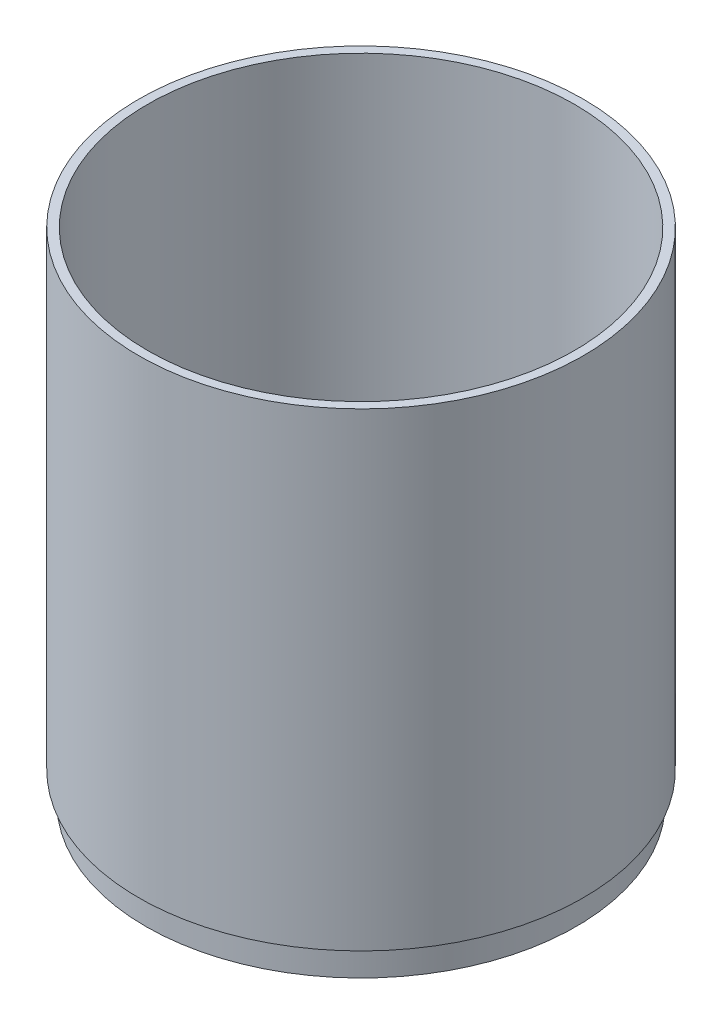
ISO-10303-21;
HEADER;
FILE_DESCRIPTION(('STEP AP214'),'2;1');
FILE_NAME('part.step','',(''),(''),'','','');
FILE_SCHEMA(('AUTOMOTIVE_DESIGN { 1 0 10303 214 1 1 1 1 }'));
ENDSEC;
DATA;
#1=APPLICATION_CONTEXT('core data for automotive mechanical design processes');
#2=APPLICATION_PROTOCOL_DEFINITION('international standard','automotive_design',2000,#1);
#3=PRODUCT_CONTEXT('',#1,'mechanical');
#4=PRODUCT('Part','Part','',(#3));
#5=PRODUCT_RELATED_PRODUCT_CATEGORY('part','',(#4));
#6=PRODUCT_DEFINITION_FORMATION('','',#4);
#7=PRODUCT_DEFINITION_CONTEXT('part definition',#1,'design');
#8=PRODUCT_DEFINITION('design','',#6,#7);
#9=PRODUCT_DEFINITION_SHAPE('','',#8);
#10=(LENGTH_UNIT() NAMED_UNIT(*) SI_UNIT(.MILLI.,.METRE.));
#11=(NAMED_UNIT(*) PLANE_ANGLE_UNIT() SI_UNIT($,.RADIAN.));
#12=(NAMED_UNIT(*) SI_UNIT($,.STERADIAN.) SOLID_ANGLE_UNIT());
#13=UNCERTAINTY_MEASURE_WITH_UNIT(LENGTH_MEASURE(1.E-05),#10,'distance_accuracy_value','');
#14=(GEOMETRIC_REPRESENTATION_CONTEXT(3) GLOBAL_UNCERTAINTY_ASSIGNED_CONTEXT((#13)) GLOBAL_UNIT_ASSIGNED_CONTEXT((#10,
#11,#12)) REPRESENTATION_CONTEXT('',''));
#15=CARTESIAN_POINT('',(0.,0.,0.));
#16=DIRECTION('',(0.,0.,1.));
#17=DIRECTION('',(1.,0.,0.));
#18=AXIS2_PLACEMENT_3D('',#15,#16,#17);
#19=CARTESIAN_POINT('',(60.5,0.,0.));
#20=DIRECTION('',(0.,-1.,0.));
#21=DIRECTION('',(0.,0.,-1.));
#22=AXIS2_PLACEMENT_3D('',#19,#20,#21);
#23=PLANE('',#22);
#24=CARTESIAN_POINT('',(0.,0.,0.));
#25=DIRECTION('',(0.,-1.,0.));
#26=DIRECTION('',(0.,0.,-1.));
#27=AXIS2_PLACEMENT_3D('',#24,#25,#26);
#28=CIRCLE('',#27,60.5);
#29=CARTESIAN_POINT('',(0.,0.,-60.5));
#30=VERTEX_POINT('',#29);
#31=EDGE_CURVE('E11',#30,#30,#28,.T.);
#32=ORIENTED_EDGE('',*,*,#31,.T.);
#33=EDGE_LOOP('',(#32));
#34=FACE_BOUND('',#33,.T.);
#35=CARTESIAN_POINT('',(0.,0.,0.));
#36=DIRECTION('',(0.,-1.,0.));
#37=DIRECTION('',(0.,0.,-1.));
#38=AXIS2_PLACEMENT_3D('',#35,#36,#37);
#39=CIRCLE('',#38,15.);
#40=CARTESIAN_POINT('',(0.,0.,-15.));
#41=VERTEX_POINT('',#40);
#42=EDGE_CURVE('E50',#41,#41,#39,.T.);
#43=ORIENTED_EDGE('',*,*,#42,.F.);
#44=EDGE_LOOP('',(#43));
#45=FACE_BOUND('',#44,.T.);
#46=DIRECTION('',(-1.,0.,0.));
#47=VECTOR('',#46,1.);
#48=CARTESIAN_POINT('',(60.5,0.,4.00000000000063));
#49=LINE('',#48,#47);
#50=CARTESIAN_POINT('',(58.3630876496437,0.,4.0000000000006));
#51=VERTEX_POINT('',#50);
#52=CARTESIAN_POINT('',(19.5959179422654,0.,4.0000000000002));
#53=VERTEX_POINT('',#52);
#54=EDGE_CURVE('E269',#51,#53,#49,.T.);
#55=ORIENTED_EDGE('',*,*,#54,.T.);
#56=CARTESIAN_POINT('',(0.,0.,0.));
#57=DIRECTION('',(0.,-1.,0.));
#58=DIRECTION('',(0.,0.,-1.));
#59=AXIS2_PLACEMENT_3D('',#56,#57,#58);
#60=CIRCLE('',#59,20.);
#61=CARTESIAN_POINT('',(4.,0.,19.5959179422654));
#62=VERTEX_POINT('',#61);
#63=EDGE_CURVE('E273',#53,#62,#60,.T.);
#64=ORIENTED_EDGE('',*,*,#63,.T.);
#65=DIRECTION('',(0.,0.,-1.));
#66=VECTOR('',#65,1.);
#67=CARTESIAN_POINT('',(4.,0.,0.));
#68=LINE('',#67,#66);
#69=CARTESIAN_POINT('',(4.,0.,58.3630876496438));
#70=VERTEX_POINT('',#69);
#71=EDGE_CURVE('E253',#70,#62,#68,.T.);
#72=ORIENTED_EDGE('',*,*,#71,.F.);
#73=CARTESIAN_POINT('',(0.,0.,0.));
#74=DIRECTION('',(0.,-1.,0.));
#75=DIRECTION('',(0.,0.,-1.));
#76=AXIS2_PLACEMENT_3D('',#73,#74,#75);
#77=CIRCLE('',#76,58.5);
#78=EDGE_CURVE('E265',#51,#70,#77,.T.);
#79=ORIENTED_EDGE('',*,*,#78,.F.);
#80=EDGE_LOOP('',(#55,#64,#72,#79));
#81=FACE_BOUND('',#80,.T.);
#82=DIRECTION('',(-0.382683432365091,0.,0.923879532511287));
#83=VECTOR('',#82,1.);
#84=CARTESIAN_POINT('',(8.86001986910698,0.,-21.3899801308931));
#85=LINE('',#84,#83);
#86=CARTESIAN_POINT('',(22.3869807933578,0.,-54.0469526519103));
#87=VERTEX_POINT('',#86);
#88=CARTESIAN_POINT('',(7.65366864730181,0.,-18.4775906502257));
#89=VERTEX_POINT('',#88);
#90=EDGE_CURVE('E283',#87,#89,#85,.T.);
#91=ORIENTED_EDGE('',*,*,#90,.T.);
#92=CARTESIAN_POINT('',(0.,0.,0.));
#93=DIRECTION('',(0.,-1.,0.));
#94=DIRECTION('',(0.,0.,-1.));
#95=AXIS2_PLACEMENT_3D('',#92,#93,#94);
#96=CIRCLE('',#95,20.);
#97=CARTESIAN_POINT('',(19.5959179422655,0.,-3.99999999999979));
#98=VERTEX_POINT('',#97);
#99=EDGE_CURVE('E287',#89,#98,#96,.T.);
#100=ORIENTED_EDGE('',*,*,#99,.T.);
#101=DIRECTION('',(-1.,0.,0.));
#102=VECTOR('',#101,1.);
#103=CARTESIAN_POINT('',(60.5,0.,-3.99999999999936));
#104=LINE('',#103,#102);
#105=CARTESIAN_POINT('',(58.3630876496438,0.,-3.99999999999938));
#106=VERTEX_POINT('',#105);
#107=EDGE_CURVE('E161',#106,#98,#104,.T.);
#108=ORIENTED_EDGE('',*,*,#107,.F.);
#109=CARTESIAN_POINT('',(0.,0.,0.));
#110=DIRECTION('',(0.,-1.,0.));
#111=DIRECTION('',(0.,0.,-1.));
#112=AXIS2_PLACEMENT_3D('',#109,#110,#111);
#113=CIRCLE('',#112,58.5);
#114=EDGE_CURVE('E279',#87,#106,#113,.T.);
#115=ORIENTED_EDGE('',*,*,#114,.F.);
#116=EDGE_LOOP('',(#91,#100,#108,#115));
#117=FACE_BOUND('',#116,.T.);
#118=DIRECTION('',(1.,0.,0.));
#119=VECTOR('',#118,1.);
#120=CARTESIAN_POINT('',(60.5,0.,-3.9999999999998));
#121=LINE('',#120,#119);
#122=CARTESIAN_POINT('',(-58.3630876496437,0.,-4.0000000000002));
#123=VERTEX_POINT('',#122);
#124=CARTESIAN_POINT('',(-19.5959179422654,0.,-4.00000000000007));
#125=VERTEX_POINT('',#124);
#126=EDGE_CURVE('E296',#123,#125,#121,.T.);
#127=ORIENTED_EDGE('',*,*,#126,.T.);
#128=CARTESIAN_POINT('',(0.,0.,0.));
#129=DIRECTION('',(0.,-1.,0.));
#130=DIRECTION('',(0.,0.,-1.));
#131=AXIS2_PLACEMENT_3D('',#128,#129,#130);
#132=CIRCLE('',#131,20.);
#133=CARTESIAN_POINT('',(-7.65366864730181,0.,-18.4775906502257));
#134=VERTEX_POINT('',#133);
#135=EDGE_CURVE('E300',#125,#134,#132,.T.);
#136=ORIENTED_EDGE('',*,*,#135,.T.);
#137=DIRECTION('',(0.382683432365091,0.,0.923879532511287));
#138=VECTOR('',#137,1.);
#139=CARTESIAN_POINT('',(8.86001986910698,0.,21.3899801308931));
#140=LINE('',#139,#138);
#141=CARTESIAN_POINT('',(-22.3869807933578,0.,-54.0469526519103));
#142=VERTEX_POINT('',#141);
#143=EDGE_CURVE('E290',#142,#134,#140,.T.);
#144=ORIENTED_EDGE('',*,*,#143,.F.);
#145=CARTESIAN_POINT('',(0.,0.,0.));
#146=DIRECTION('',(0.,-1.,0.));
#147=DIRECTION('',(0.,0.,-1.));
#148=AXIS2_PLACEMENT_3D('',#145,#146,#147);
#149=CIRCLE('',#148,58.5);
#150=EDGE_CURVE('E293',#123,#142,#149,.T.);
#151=ORIENTED_EDGE('',*,*,#150,.F.);
#152=EDGE_LOOP('',(#127,#136,#144,#151));
#153=FACE_BOUND('',#152,.T.);
#154=DIRECTION('',(0.,0.,-1.));
#155=VECTOR('',#154,1.);
#156=CARTESIAN_POINT('',(-4.,0.,0.));
#157=LINE('',#156,#155);
#158=CARTESIAN_POINT('',(-3.99999999999999,0.,58.3630876496438));
#159=VERTEX_POINT('',#158);
#160=CARTESIAN_POINT('',(-4.,0.,19.5959179422654));
#161=VERTEX_POINT('',#160);
#162=EDGE_CURVE('E310',#159,#161,#157,.T.);
#163=ORIENTED_EDGE('',*,*,#162,.T.);
#164=CARTESIAN_POINT('',(0.,0.,0.));
#165=DIRECTION('',(0.,-1.,0.));
#166=DIRECTION('',(0.,0.,-1.));
#167=AXIS2_PLACEMENT_3D('',#164,#165,#166);
#168=CIRCLE('',#167,20.);
#169=CARTESIAN_POINT('',(-19.5959179422654,0.,3.99999999999993));
#170=VERTEX_POINT('',#169);
#171=EDGE_CURVE('E314',#161,#170,#168,.T.);
#172=ORIENTED_EDGE('',*,*,#171,.T.);
#173=DIRECTION('',(1.,0.,0.));
#174=VECTOR('',#173,1.);
#175=CARTESIAN_POINT('',(60.5,0.,4.00000000000022));
#176=LINE('',#175,#174);
#177=CARTESIAN_POINT('',(-58.3630876496438,0.,3.99999999999979));
#178=VERTEX_POINT('',#177);
#179=EDGE_CURVE('E304',#178,#170,#176,.T.);
#180=ORIENTED_EDGE('',*,*,#179,.F.);
#181=CARTESIAN_POINT('',(0.,0.,0.));
#182=DIRECTION('',(0.,-1.,0.));
#183=DIRECTION('',(0.,0.,-1.));
#184=AXIS2_PLACEMENT_3D('',#181,#182,#183);
#185=CIRCLE('',#184,58.5);
#186=EDGE_CURVE('E307',#159,#178,#185,.T.);
#187=ORIENTED_EDGE('',*,*,#186,.F.);
#188=EDGE_LOOP('',(#163,#172,#180,#187));
#189=FACE_BOUND('',#188,.T.);
#190=ADVANCED_FACE('F41',(#34,#45,#81,#117,#153,#189),#23,.T.);
#191=CARTESIAN_POINT('',(58.5,4.,0.));
#192=DIRECTION('',(0.,1.,0.));
#193=DIRECTION('',(0.,0.,1.));
#194=AXIS2_PLACEMENT_3D('',#191,#192,#193);
#195=PLANE('',#194);
#196=CARTESIAN_POINT('',(0.,4.,0.));
#197=DIRECTION('',(0.,-1.,0.));
#198=DIRECTION('',(0.,0.,-1.));
#199=AXIS2_PLACEMENT_3D('',#196,#197,#198);
#200=CIRCLE('',#199,15.);
#201=CARTESIAN_POINT('',(0.,4.,-15.));
#202=VERTEX_POINT('',#201);
#203=EDGE_CURVE('E347',#202,#202,#200,.T.);
#204=ORIENTED_EDGE('',*,*,#203,.T.);
#205=EDGE_LOOP('',(#204));
#206=FACE_BOUND('',#205,.T.);
#207=CARTESIAN_POINT('',(0.,4.,0.));
#208=DIRECTION('',(0.,1.,0.));
#209=DIRECTION('',(0.,0.,1.));
#210=AXIS2_PLACEMENT_3D('',#207,#208,#209);
#211=CIRCLE('',#210,20.);
#212=CARTESIAN_POINT('',(-19.5959179422654,4.,3.99999999999993));
#213=VERTEX_POINT('',#212);
#214=CARTESIAN_POINT('',(-4.,4.,19.5959179422654));
#215=VERTEX_POINT('',#214);
#216=EDGE_CURVE('E220',#213,#215,#211,.T.);
#217=ORIENTED_EDGE('',*,*,#216,.T.);
#218=DIRECTION('',(0.,0.,1.));
#219=VECTOR('',#218,1.);
#220=CARTESIAN_POINT('',(-4.,4.,0.));
#221=LINE('',#220,#219);
#222=CARTESIAN_POINT('',(-3.99999999999999,4.,58.3630876496438));
#223=VERTEX_POINT('',#222);
#224=EDGE_CURVE('E226',#215,#223,#221,.T.);
#225=ORIENTED_EDGE('',*,*,#224,.T.);
#226=CARTESIAN_POINT('',(0.,4.00000000000001,0.));
#227=DIRECTION('',(0.,-1.,0.));
#228=DIRECTION('',(0.,0.,-1.));
#229=AXIS2_PLACEMENT_3D('',#226,#227,#228);
#230=CIRCLE('',#229,58.5);
#231=CARTESIAN_POINT('',(3.99999999999999,4.00000000000001,58.3630876496438));
#232=VERTEX_POINT('',#231);
#233=EDGE_CURVE('E378',#232,#223,#230,.T.);
#234=ORIENTED_EDGE('',*,*,#233,.F.);
#235=DIRECTION('',(0.,0.,1.));
#236=VECTOR('',#235,1.);
#237=CARTESIAN_POINT('',(4.,4.,0.));
#238=LINE('',#237,#236);
#239=CARTESIAN_POINT('',(4.,4.,19.5959179422654));
#240=VERTEX_POINT('',#239);
#241=EDGE_CURVE('E243',#240,#232,#238,.T.);
#242=ORIENTED_EDGE('',*,*,#241,.F.);
#243=CARTESIAN_POINT('',(0.,4.,0.));
#244=DIRECTION('',(0.,1.,0.));
#245=DIRECTION('',(0.,0.,1.));
#246=AXIS2_PLACEMENT_3D('',#243,#244,#245);
#247=CIRCLE('',#246,20.);
#248=CARTESIAN_POINT('',(19.5959179422654,4.,4.0000000000002));
#249=VERTEX_POINT('',#248);
#250=EDGE_CURVE('E192',#240,#249,#247,.T.);
#251=ORIENTED_EDGE('',*,*,#250,.T.);
#252=DIRECTION('',(1.,0.,0.));
#253=VECTOR('',#252,1.);
#254=CARTESIAN_POINT('',(0.,4.,4.));
#255=LINE('',#254,#253);
#256=CARTESIAN_POINT('',(58.3630876496437,4.,4.0000000000006));
#257=VERTEX_POINT('',#256);
#258=EDGE_CURVE('E246',#249,#257,#255,.T.);
#259=ORIENTED_EDGE('',*,*,#258,.T.);
#260=CARTESIAN_POINT('',(58.3630876496438,4.00000000000001,-3.99999999999938));
#261=VERTEX_POINT('',#260);
#262=EDGE_CURVE('E184',#261,#257,#230,.T.);
#263=ORIENTED_EDGE('',*,*,#262,.F.);
#264=DIRECTION('',(1.,0.,0.));
#265=VECTOR('',#264,1.);
#266=CARTESIAN_POINT('',(0.,4.,-4.));
#267=LINE('',#266,#265);
#268=CARTESIAN_POINT('',(19.5959179422655,4.,-3.99999999999979));
#269=VERTEX_POINT('',#268);
#270=EDGE_CURVE('E158',#269,#261,#267,.T.);
#271=ORIENTED_EDGE('',*,*,#270,.F.);
#272=CARTESIAN_POINT('',(0.,4.,0.));
#273=DIRECTION('',(0.,1.,0.));
#274=DIRECTION('',(0.,0.,1.));
#275=AXIS2_PLACEMENT_3D('',#272,#273,#274);
#276=CIRCLE('',#275,20.);
#277=CARTESIAN_POINT('',(7.65366864730181,4.,-18.4775906502257));
#278=VERTEX_POINT('',#277);
#279=EDGE_CURVE('E169',#269,#278,#276,.T.);
#280=ORIENTED_EDGE('',*,*,#279,.T.);
#281=DIRECTION('',(0.382683432365091,0.,-0.923879532511287));
#282=VECTOR('',#281,1.);
#283=CARTESIAN_POINT('',(0.,4.,0.));
#284=LINE('',#283,#282);
#285=CARTESIAN_POINT('',(22.3869807933578,4.,-54.0469526519103));
#286=VERTEX_POINT('',#285);
#287=EDGE_CURVE('E166',#278,#286,#284,.T.);
#288=ORIENTED_EDGE('',*,*,#287,.T.);
#289=CARTESIAN_POINT('',(-22.3869807933578,4.00000000000001,-54.0469526519103));
#290=VERTEX_POINT('',#289);
#291=EDGE_CURVE('E342',#290,#286,#230,.T.);
#292=ORIENTED_EDGE('',*,*,#291,.F.);
#293=DIRECTION('',(-0.382683432365091,0.,-0.923879532511287));
#294=VECTOR('',#293,1.);
#295=CARTESIAN_POINT('',(0.,4.,0.));
#296=LINE('',#295,#294);
#297=CARTESIAN_POINT('',(-7.65366864730181,4.,-18.4775906502257));
#298=VERTEX_POINT('',#297);
#299=EDGE_CURVE('E202',#298,#290,#296,.T.);
#300=ORIENTED_EDGE('',*,*,#299,.F.);
#301=CARTESIAN_POINT('',(0.,4.,0.));
#302=DIRECTION('',(0.,1.,0.));
#303=DIRECTION('',(0.,0.,1.));
#304=AXIS2_PLACEMENT_3D('',#301,#302,#303);
#305=CIRCLE('',#304,20.);
#306=CARTESIAN_POINT('',(-19.5959179422654,4.,-4.00000000000007));
#307=VERTEX_POINT('',#306);
#308=EDGE_CURVE('E198',#298,#307,#305,.T.);
#309=ORIENTED_EDGE('',*,*,#308,.T.);
#310=DIRECTION('',(-1.,0.,0.));
#311=VECTOR('',#310,1.);
#312=CARTESIAN_POINT('',(0.,4.,-4.));
#313=LINE('',#312,#311);
#314=CARTESIAN_POINT('',(-58.3630876496437,4.,-4.0000000000002));
#315=VERTEX_POINT('',#314);
#316=EDGE_CURVE('E206',#307,#315,#313,.T.);
#317=ORIENTED_EDGE('',*,*,#316,.T.);
#318=CARTESIAN_POINT('',(-58.3630876496438,4.00000000000001,3.99999999999979));
#319=VERTEX_POINT('',#318);
#320=EDGE_CURVE('E346',#319,#315,#230,.T.);
#321=ORIENTED_EDGE('',*,*,#320,.F.);
#322=DIRECTION('',(-1.,0.,0.));
#323=VECTOR('',#322,1.);
#324=CARTESIAN_POINT('',(0.,4.,4.));
#325=LINE('',#324,#323);
#326=EDGE_CURVE('E223',#213,#319,#325,.T.);
#327=ORIENTED_EDGE('',*,*,#326,.F.);
#328=EDGE_LOOP('',(#217,#225,#234,#242,#251,#259,#263,#271,#280,#288,#292,#300,#309,#317,#321,#327));
#329=FACE_BOUND('',#328,.T.);
#330=ADVANCED_FACE('F181',(#206,#329),#195,.T.);
#331=CARTESIAN_POINT('',(0.,0.,0.));
#332=DIRECTION('',(0.,-1.,0.));
#333=DIRECTION('',(0.,0.,-1.));
#334=AXIS2_PLACEMENT_3D('',#331,#332,#333);
#335=CYLINDRICAL_SURFACE('',#334,60.5);
#336=CARTESIAN_POINT('',(0.,8.,0.));
#337=DIRECTION('',(0.,-1.,0.));
#338=DIRECTION('',(0.,0.,-1.));
#339=AXIS2_PLACEMENT_3D('',#336,#337,#338);
#340=CIRCLE('',#339,60.5);
#341=CARTESIAN_POINT('',(0.,8.,-60.5));
#342=VERTEX_POINT('',#341);
#343=EDGE_CURVE('E318',#342,#342,#340,.T.);
#344=ORIENTED_EDGE('',*,*,#343,.T.);
#345=EDGE_LOOP('',(#344));
#346=FACE_BOUND('',#345,.T.);
#347=ORIENTED_EDGE('',*,*,#31,.F.);
#348=EDGE_LOOP('',(#347));
#349=FACE_BOUND('',#348,.T.);
#350=ADVANCED_FACE('F43',(#346,#349),#335,.T.);
#351=CARTESIAN_POINT('',(0.,0.,0.));
#352=DIRECTION('',(0.,-1.,0.));
#353=DIRECTION('',(0.,0.,-1.));
#354=AXIS2_PLACEMENT_3D('',#351,#352,#353);
#355=CYLINDRICAL_SURFACE('',#354,15.);
#356=ORIENTED_EDGE('',*,*,#42,.T.);
#357=EDGE_LOOP('',(#356));
#358=FACE_BOUND('',#357,.T.);
#359=ORIENTED_EDGE('',*,*,#203,.F.);
#360=EDGE_LOOP('',(#359));
#361=FACE_BOUND('',#360,.T.);
#362=ADVANCED_FACE('F354',(#358,#361),#355,.F.);
#363=CARTESIAN_POINT('',(0.,0.,0.));
#364=DIRECTION('',(0.,-1.,0.));
#365=DIRECTION('',(0.,0.,-1.));
#366=AXIS2_PLACEMENT_3D('',#363,#364,#365);
#367=CYLINDRICAL_SURFACE('',#366,58.5);
#368=ORIENTED_EDGE('',*,*,#291,.T.);
#369=DIRECTION('',(0.,1.,0.));
#370=VECTOR('',#369,1.);
#371=CARTESIAN_POINT('',(22.3869807933578,-6.,-54.0469526519103));
#372=LINE('',#371,#370);
#373=EDGE_CURVE('E193',#87,#286,#372,.T.);
#374=ORIENTED_EDGE('',*,*,#373,.F.);
#375=ORIENTED_EDGE('',*,*,#114,.T.);
#376=DIRECTION('',(0.,1.,0.));
#377=VECTOR('',#376,1.);
#378=CARTESIAN_POINT('',(58.3630876496438,-6.,-3.99999999999938));
#379=LINE('',#378,#377);
#380=EDGE_CURVE('E165',#106,#261,#379,.T.);
#381=ORIENTED_EDGE('',*,*,#380,.T.);
#382=ORIENTED_EDGE('',*,*,#262,.T.);
#383=DIRECTION('',(0.,1.,0.));
#384=VECTOR('',#383,1.);
#385=CARTESIAN_POINT('',(58.3630876496437,-6.,4.0000000000006));
#386=LINE('',#385,#384);
#387=EDGE_CURVE('E254',#51,#257,#386,.T.);
#388=ORIENTED_EDGE('',*,*,#387,.F.);
#389=ORIENTED_EDGE('',*,*,#78,.T.);
#390=DIRECTION('',(0.,1.,0.));
#391=VECTOR('',#390,1.);
#392=CARTESIAN_POINT('',(3.99999999999999,-6.,58.3630876496438));
#393=LINE('',#392,#391);
#394=EDGE_CURVE('E257',#70,#232,#393,.T.);
#395=ORIENTED_EDGE('',*,*,#394,.T.);
#396=ORIENTED_EDGE('',*,*,#233,.T.);
#397=DIRECTION('',(0.,1.,0.));
#398=VECTOR('',#397,1.);
#399=CARTESIAN_POINT('',(-3.99999999999999,-6.,58.3630876496438));
#400=LINE('',#399,#398);
#401=EDGE_CURVE('E233',#159,#223,#400,.T.);
#402=ORIENTED_EDGE('',*,*,#401,.F.);
#403=ORIENTED_EDGE('',*,*,#186,.T.);
#404=DIRECTION('',(0.,1.,0.));
#405=VECTOR('',#404,1.);
#406=CARTESIAN_POINT('',(-58.3630876496438,-6.,3.99999999999979));
#407=LINE('',#406,#405);
#408=EDGE_CURVE('E57',#178,#319,#407,.T.);
#409=ORIENTED_EDGE('',*,*,#408,.T.);
#410=ORIENTED_EDGE('',*,*,#320,.T.);
#411=DIRECTION('',(0.,1.,0.));
#412=VECTOR('',#411,1.);
#413=CARTESIAN_POINT('',(-58.3630876496437,-6.,-4.0000000000002));
#414=LINE('',#413,#412);
#415=EDGE_CURVE('E213',#123,#315,#414,.T.);
#416=ORIENTED_EDGE('',*,*,#415,.F.);
#417=ORIENTED_EDGE('',*,*,#150,.T.);
#418=DIRECTION('',(0.,1.,0.));
#419=VECTOR('',#418,1.);
#420=CARTESIAN_POINT('',(-22.3869807933578,-6.,-54.0469526519103));
#421=LINE('',#420,#419);
#422=EDGE_CURVE('E65',#142,#290,#421,.T.);
#423=ORIENTED_EDGE('',*,*,#422,.T.);
#424=EDGE_LOOP('',(#368,#374,#375,#381,#382,#388,#389,#395,#396,#402,#403,#409,#410,#416,#417,#423));
#425=FACE_BOUND('',#424,.T.);
#426=CARTESIAN_POINT('',(0.,10.,0.));
#427=DIRECTION('',(0.,-1.,0.));
#428=DIRECTION('',(0.,0.,-1.));
#429=AXIS2_PLACEMENT_3D('',#426,#427,#428);
#430=CIRCLE('',#429,58.5);
#431=CARTESIAN_POINT('',(0.,10.,-58.5));
#432=VERTEX_POINT('',#431);
#433=EDGE_CURVE('E338',#432,#432,#430,.T.);
#434=ORIENTED_EDGE('',*,*,#433,.F.);
#435=EDGE_LOOP('',(#434));
#436=FACE_BOUND('',#435,.T.);
#437=ADVANCED_FACE('F375',(#425,#436),#367,.F.);
#438=CARTESIAN_POINT('',(58.5,10.,0.));
#439=DIRECTION('',(0.,1.,0.));
#440=DIRECTION('',(0.,0.,1.));
#441=AXIS2_PLACEMENT_3D('',#438,#439,#440);
#442=PLANE('',#441);
#443=ORIENTED_EDGE('',*,*,#433,.T.);
#444=EDGE_LOOP('',(#443));
#445=FACE_BOUND('',#444,.T.);
#446=CARTESIAN_POINT('',(0.,10.,0.));
#447=DIRECTION('',(0.,-1.,0.));
#448=DIRECTION('',(0.,0.,-1.));
#449=AXIS2_PLACEMENT_3D('',#446,#447,#448);
#450=CIRCLE('',#449,60.);
#451=CARTESIAN_POINT('',(0.,10.,-60.));
#452=VERTEX_POINT('',#451);
#453=EDGE_CURVE('E334',#452,#452,#450,.T.);
#454=ORIENTED_EDGE('',*,*,#453,.F.);
#455=EDGE_LOOP('',(#454));
#456=FACE_BOUND('',#455,.T.);
#457=ADVANCED_FACE('F441',(#445,#456),#442,.T.);
#458=CARTESIAN_POINT('',(0.,0.,0.));
#459=DIRECTION('',(0.,-1.,0.));
#460=DIRECTION('',(0.,0.,-1.));
#461=AXIS2_PLACEMENT_3D('',#458,#459,#460);
#462=CYLINDRICAL_SURFACE('',#461,60.);
#463=ORIENTED_EDGE('',*,*,#453,.T.);
#464=EDGE_LOOP('',(#463));
#465=FACE_BOUND('',#464,.T.);
#466=CARTESIAN_POINT('',(0.,140.,0.));
#467=DIRECTION('',(0.,-1.,0.));
#468=DIRECTION('',(0.,0.,-1.));
#469=AXIS2_PLACEMENT_3D('',#466,#467,#468);
#470=CIRCLE('',#469,60.);
#471=CARTESIAN_POINT('',(0.,140.,-60.));
#472=VERTEX_POINT('',#471);
#473=EDGE_CURVE('E330',#472,#472,#470,.T.);
#474=ORIENTED_EDGE('',*,*,#473,.F.);
#475=EDGE_LOOP('',(#474));
#476=FACE_BOUND('',#475,.T.);
#477=ADVANCED_FACE('F437',(#465,#476),#462,.F.);
#478=CARTESIAN_POINT('',(62.5,140.,0.));
#479=DIRECTION('',(0.,1.,0.));
#480=DIRECTION('',(0.,0.,1.));
#481=AXIS2_PLACEMENT_3D('',#478,#479,#480);
#482=PLANE('',#481);
#483=ORIENTED_EDGE('',*,*,#473,.T.);
#484=EDGE_LOOP('',(#483));
#485=FACE_BOUND('',#484,.T.);
#486=CARTESIAN_POINT('',(0.,140.,0.));
#487=DIRECTION('',(0.,-1.,0.));
#488=DIRECTION('',(0.,0.,-1.));
#489=AXIS2_PLACEMENT_3D('',#486,#487,#488);
#490=CIRCLE('',#489,62.5);
#491=CARTESIAN_POINT('',(0.,140.,-62.5));
#492=VERTEX_POINT('',#491);
#493=EDGE_CURVE('E326',#492,#492,#490,.T.);
#494=ORIENTED_EDGE('',*,*,#493,.F.);
#495=EDGE_LOOP('',(#494));
#496=FACE_BOUND('',#495,.T.);
#497=ADVANCED_FACE('F433',(#485,#496),#482,.T.);
#498=CARTESIAN_POINT('',(0.,0.,0.));
#499=DIRECTION('',(0.,-1.,0.));
#500=DIRECTION('',(0.,0.,-1.));
#501=AXIS2_PLACEMENT_3D('',#498,#499,#500);
#502=CYLINDRICAL_SURFACE('',#501,62.5);
#503=ORIENTED_EDGE('',*,*,#493,.T.);
#504=EDGE_LOOP('',(#503));
#505=FACE_BOUND('',#504,.T.);
#506=CARTESIAN_POINT('',(0.,8.,0.));
#507=DIRECTION('',(0.,-1.,0.));
#508=DIRECTION('',(0.,0.,-1.));
#509=AXIS2_PLACEMENT_3D('',#506,#507,#508);
#510=CIRCLE('',#509,62.5);
#511=CARTESIAN_POINT('',(0.,8.,-62.5));
#512=VERTEX_POINT('',#511);
#513=EDGE_CURVE('E322',#512,#512,#510,.T.);
#514=ORIENTED_EDGE('',*,*,#513,.F.);
#515=EDGE_LOOP('',(#514));
#516=FACE_BOUND('',#515,.T.);
#517=ADVANCED_FACE('F429',(#505,#516),#502,.T.);
#518=CARTESIAN_POINT('',(60.5,8.,0.));
#519=DIRECTION('',(0.,-1.,0.));
#520=DIRECTION('',(0.,0.,-1.));
#521=AXIS2_PLACEMENT_3D('',#518,#519,#520);
#522=PLANE('',#521);
#523=ORIENTED_EDGE('',*,*,#513,.T.);
#524=EDGE_LOOP('',(#523));
#525=FACE_BOUND('',#524,.T.);
#526=ORIENTED_EDGE('',*,*,#343,.F.);
#527=EDGE_LOOP('',(#526));
#528=FACE_BOUND('',#527,.T.);
#529=ADVANCED_FACE('F421',(#525,#528),#522,.T.);
#530=CARTESIAN_POINT('',(0.,-6.,0.));
#531=DIRECTION('',(0.,1.,0.));
#532=DIRECTION('',(0.,0.,1.));
#533=AXIS2_PLACEMENT_3D('',#530,#531,#532);
#534=CYLINDRICAL_SURFACE('',#533,20.);
#535=DIRECTION('',(0.,1.,0.));
#536=VECTOR('',#535,1.);
#537=CARTESIAN_POINT('',(19.5959179422654,-6.,4.0000000000002));
#538=LINE('',#537,#536);
#539=EDGE_CURVE('E250',#53,#249,#538,.T.);
#540=ORIENTED_EDGE('',*,*,#539,.T.);
#541=ORIENTED_EDGE('',*,*,#250,.F.);
#542=DIRECTION('',(0.,1.,0.));
#543=VECTOR('',#542,1.);
#544=CARTESIAN_POINT('',(4.,-6.,19.5959179422654));
#545=LINE('',#544,#543);
#546=EDGE_CURVE('E249',#62,#240,#545,.T.);
#547=ORIENTED_EDGE('',*,*,#546,.F.);
#548=ORIENTED_EDGE('',*,*,#63,.F.);
#549=EDGE_LOOP('',(#540,#541,#547,#548));
#550=FACE_BOUND('',#549,.T.);
#551=ADVANCED_FACE('F411',(#550),#534,.T.);
#552=CARTESIAN_POINT('',(0.,-6.,4.));
#553=DIRECTION('',(0.,0.,1.));
#554=DIRECTION('',(1.,0.,0.));
#555=AXIS2_PLACEMENT_3D('',#552,#553,#554);
#556=PLANE('',#555);
#557=ORIENTED_EDGE('',*,*,#387,.T.);
#558=ORIENTED_EDGE('',*,*,#258,.F.);
#559=ORIENTED_EDGE('',*,*,#539,.F.);
#560=ORIENTED_EDGE('',*,*,#54,.F.);
#561=EDGE_LOOP('',(#557,#558,#559,#560));
#562=FACE_BOUND('',#561,.T.);
#563=ADVANCED_FACE('F413',(#562),#556,.T.);
#564=CARTESIAN_POINT('',(4.,-6.,0.));
#565=DIRECTION('',(-1.,0.,0.));
#566=DIRECTION('',(0.,0.,1.));
#567=AXIS2_PLACEMENT_3D('',#564,#565,#566);
#568=PLANE('',#567);
#569=ORIENTED_EDGE('',*,*,#71,.T.);
#570=ORIENTED_EDGE('',*,*,#546,.T.);
#571=ORIENTED_EDGE('',*,*,#241,.T.);
#572=ORIENTED_EDGE('',*,*,#394,.F.);
#573=EDGE_LOOP('',(#569,#570,#571,#572));
#574=FACE_BOUND('',#573,.T.);
#575=ADVANCED_FACE('F408',(#574),#568,.F.);
#576=CARTESIAN_POINT('',(0.,-6.,0.));
#577=DIRECTION('',(0.,1.,0.));
#578=DIRECTION('',(0.,0.,1.));
#579=AXIS2_PLACEMENT_3D('',#576,#577,#578);
#580=CYLINDRICAL_SURFACE('',#579,20.);
#581=DIRECTION('',(0.,1.,0.));
#582=VECTOR('',#581,1.);
#583=CARTESIAN_POINT('',(7.65366864730181,-6.,-18.4775906502257));
#584=LINE('',#583,#582);
#585=EDGE_CURVE('E172',#89,#278,#584,.T.);
#586=ORIENTED_EDGE('',*,*,#585,.T.);
#587=ORIENTED_EDGE('',*,*,#279,.F.);
#588=DIRECTION('',(0.,1.,0.));
#589=VECTOR('',#588,1.);
#590=CARTESIAN_POINT('',(19.5959179422655,-6.,-3.99999999999979));
#591=LINE('',#590,#589);
#592=EDGE_CURVE('E154',#98,#269,#591,.T.);
#593=ORIENTED_EDGE('',*,*,#592,.F.);
#594=ORIENTED_EDGE('',*,*,#99,.F.);
#595=EDGE_LOOP('',(#586,#587,#593,#594));
#596=FACE_BOUND('',#595,.T.);
#597=ADVANCED_FACE('F170',(#596),#580,.T.);
#598=CARTESIAN_POINT('',(0.,-6.,0.));
#599=DIRECTION('',(0.923879532511287,0.,0.382683432365091));
#600=DIRECTION('',(0.382683432365091,0.,-0.923879532511287));
#601=AXIS2_PLACEMENT_3D('',#598,#599,#600);
#602=PLANE('',#601);
#603=ORIENTED_EDGE('',*,*,#373,.T.);
#604=ORIENTED_EDGE('',*,*,#287,.F.);
#605=ORIENTED_EDGE('',*,*,#585,.F.);
#606=ORIENTED_EDGE('',*,*,#90,.F.);
#607=EDGE_LOOP('',(#603,#604,#605,#606));
#608=FACE_BOUND('',#607,.T.);
#609=ADVANCED_FACE('F401',(#608),#602,.T.);
#610=CARTESIAN_POINT('',(0.,-6.,-4.));
#611=DIRECTION('',(0.,0.,1.));
#612=DIRECTION('',(1.,0.,0.));
#613=AXIS2_PLACEMENT_3D('',#610,#611,#612);
#614=PLANE('',#613);
#615=ORIENTED_EDGE('',*,*,#107,.T.);
#616=ORIENTED_EDGE('',*,*,#592,.T.);
#617=ORIENTED_EDGE('',*,*,#270,.T.);
#618=ORIENTED_EDGE('',*,*,#380,.F.);
#619=EDGE_LOOP('',(#615,#616,#617,#618));
#620=FACE_BOUND('',#619,.T.);
#621=ADVANCED_FACE('F156',(#620),#614,.F.);
#622=CARTESIAN_POINT('',(0.,-6.,0.));
#623=DIRECTION('',(0.,1.,0.));
#624=DIRECTION('',(0.,0.,1.));
#625=AXIS2_PLACEMENT_3D('',#622,#623,#624);
#626=CYLINDRICAL_SURFACE('',#625,20.);
#627=DIRECTION('',(0.,1.,0.));
#628=VECTOR('',#627,1.);
#629=CARTESIAN_POINT('',(-19.5959179422654,-6.,-4.00000000000007));
#630=LINE('',#629,#628);
#631=EDGE_CURVE('E177',#125,#307,#630,.T.);
#632=ORIENTED_EDGE('',*,*,#631,.T.);
#633=ORIENTED_EDGE('',*,*,#308,.F.);
#634=DIRECTION('',(0.,1.,0.));
#635=VECTOR('',#634,1.);
#636=CARTESIAN_POINT('',(-7.65366864730181,-6.,-18.4775906502257));
#637=LINE('',#636,#635);
#638=EDGE_CURVE('E210',#134,#298,#637,.T.);
#639=ORIENTED_EDGE('',*,*,#638,.F.);
#640=ORIENTED_EDGE('',*,*,#135,.F.);
#641=EDGE_LOOP('',(#632,#633,#639,#640));
#642=FACE_BOUND('',#641,.T.);
#643=ADVANCED_FACE('F394',(#642),#626,.T.);
#644=CARTESIAN_POINT('',(0.,-6.,-4.));
#645=DIRECTION('',(0.,0.,-1.));
#646=DIRECTION('',(-1.,0.,0.));
#647=AXIS2_PLACEMENT_3D('',#644,#645,#646);
#648=PLANE('',#647);
#649=ORIENTED_EDGE('',*,*,#415,.T.);
#650=ORIENTED_EDGE('',*,*,#316,.F.);
#651=ORIENTED_EDGE('',*,*,#631,.F.);
#652=ORIENTED_EDGE('',*,*,#126,.F.);
#653=EDGE_LOOP('',(#649,#650,#651,#652));
#654=FACE_BOUND('',#653,.T.);
#655=ADVANCED_FACE('F392',(#654),#648,.T.);
#656=CARTESIAN_POINT('',(0.,-6.,0.));
#657=DIRECTION('',(0.923879532511287,0.,-0.382683432365091));
#658=DIRECTION('',(-0.382683432365091,0.,-0.923879532511287));
#659=AXIS2_PLACEMENT_3D('',#656,#657,#658);
#660=PLANE('',#659);
#661=ORIENTED_EDGE('',*,*,#143,.T.);
#662=ORIENTED_EDGE('',*,*,#638,.T.);
#663=ORIENTED_EDGE('',*,*,#299,.T.);
#664=ORIENTED_EDGE('',*,*,#422,.F.);
#665=EDGE_LOOP('',(#661,#662,#663,#664));
#666=FACE_BOUND('',#665,.T.);
#667=ADVANCED_FACE('F397',(#666),#660,.F.);
#668=CARTESIAN_POINT('',(0.,-6.,0.));
#669=DIRECTION('',(0.,1.,0.));
#670=DIRECTION('',(0.,0.,1.));
#671=AXIS2_PLACEMENT_3D('',#668,#669,#670);
#672=CYLINDRICAL_SURFACE('',#671,20.);
#673=DIRECTION('',(0.,1.,0.));
#674=VECTOR('',#673,1.);
#675=CARTESIAN_POINT('',(-4.,-6.,19.5959179422654));
#676=LINE('',#675,#674);
#677=EDGE_CURVE('E203',#161,#215,#676,.T.);
#678=ORIENTED_EDGE('',*,*,#677,.T.);
#679=ORIENTED_EDGE('',*,*,#216,.F.);
#680=DIRECTION('',(0.,1.,0.));
#681=VECTOR('',#680,1.);
#682=CARTESIAN_POINT('',(-19.5959179422654,-6.,3.99999999999993));
#683=LINE('',#682,#681);
#684=EDGE_CURVE('E230',#170,#213,#683,.T.);
#685=ORIENTED_EDGE('',*,*,#684,.F.);
#686=ORIENTED_EDGE('',*,*,#171,.F.);
#687=EDGE_LOOP('',(#678,#679,#685,#686));
#688=FACE_BOUND('',#687,.T.);
#689=ADVANCED_FACE('F424',(#688),#672,.T.);
#690=CARTESIAN_POINT('',(-4.,-6.,0.));
#691=DIRECTION('',(-1.,0.,0.));
#692=DIRECTION('',(0.,0.,1.));
#693=AXIS2_PLACEMENT_3D('',#690,#691,#692);
#694=PLANE('',#693);
#695=ORIENTED_EDGE('',*,*,#401,.T.);
#696=ORIENTED_EDGE('',*,*,#224,.F.);
#697=ORIENTED_EDGE('',*,*,#677,.F.);
#698=ORIENTED_EDGE('',*,*,#162,.F.);
#699=EDGE_LOOP('',(#695,#696,#697,#698));
#700=FACE_BOUND('',#699,.T.);
#701=ADVANCED_FACE('F371',(#700),#694,.T.);
#702=CARTESIAN_POINT('',(0.,-6.,4.));
#703=DIRECTION('',(0.,0.,-1.));
#704=DIRECTION('',(-1.,0.,0.));
#705=AXIS2_PLACEMENT_3D('',#702,#703,#704);
#706=PLANE('',#705);
#707=ORIENTED_EDGE('',*,*,#179,.T.);
#708=ORIENTED_EDGE('',*,*,#684,.T.);
#709=ORIENTED_EDGE('',*,*,#326,.T.);
#710=ORIENTED_EDGE('',*,*,#408,.F.);
#711=EDGE_LOOP('',(#707,#708,#709,#710));
#712=FACE_BOUND('',#711,.T.);
#713=ADVANCED_FACE('F608',(#712),#706,.F.);
#714=CLOSED_SHELL('',(#190,#330,#350,#362,#437,#457,#477,#497,#517,#529,#551,#563,#575,#597,
#609,#621,#643,#655,#667,#689,#701,#713));
#715=MANIFOLD_SOLID_BREP('B2',#714);
#716=ADVANCED_BREP_SHAPE_REPRESENTATION('',(#18,#715),#14);
#717=SHAPE_DEFINITION_REPRESENTATION(#9,#716);
ENDSEC;
END-ISO-10303-21;
